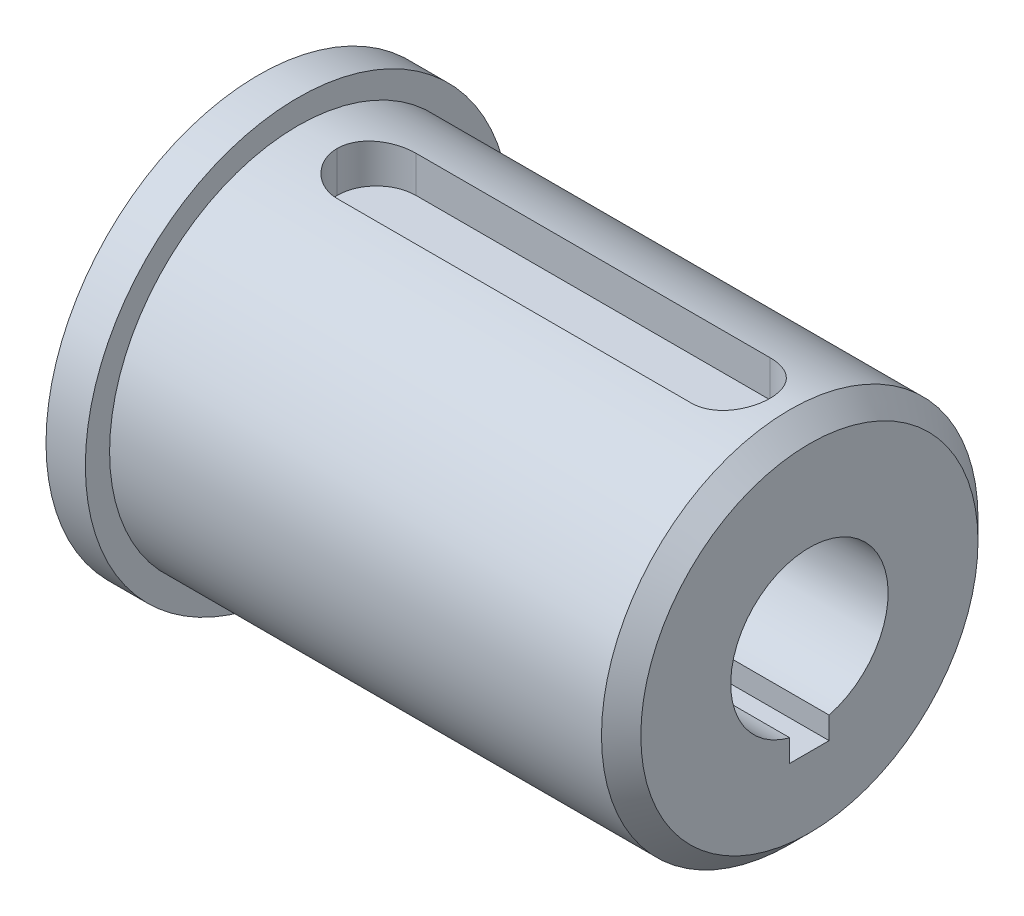
ISO-10303-21;
HEADER;
FILE_DESCRIPTION(('STEP AP214'),'2;1');
FILE_NAME('part.step','',(''),(''),'','','');
FILE_SCHEMA(('AUTOMOTIVE_DESIGN { 1 0 10303 214 1 1 1 1 }'));
ENDSEC;
DATA;
#1=APPLICATION_CONTEXT('core data for automotive mechanical design processes');
#2=APPLICATION_PROTOCOL_DEFINITION('international standard','automotive_design',2000,#1);
#3=PRODUCT_CONTEXT('',#1,'mechanical');
#4=PRODUCT('Part','Part','',(#3));
#5=PRODUCT_RELATED_PRODUCT_CATEGORY('part','',(#4));
#6=PRODUCT_DEFINITION_FORMATION('','',#4);
#7=PRODUCT_DEFINITION_CONTEXT('part definition',#1,'design');
#8=PRODUCT_DEFINITION('design','',#6,#7);
#9=PRODUCT_DEFINITION_SHAPE('','',#8);
#10=(LENGTH_UNIT() NAMED_UNIT(*) SI_UNIT(.MILLI.,.METRE.));
#11=(NAMED_UNIT(*) PLANE_ANGLE_UNIT() SI_UNIT($,.RADIAN.));
#12=(NAMED_UNIT(*) SI_UNIT($,.STERADIAN.) SOLID_ANGLE_UNIT());
#13=UNCERTAINTY_MEASURE_WITH_UNIT(LENGTH_MEASURE(1.E-05),#10,'distance_accuracy_value','');
#14=(GEOMETRIC_REPRESENTATION_CONTEXT(3) GLOBAL_UNCERTAINTY_ASSIGNED_CONTEXT((#13)) GLOBAL_UNIT_ASSIGNED_CONTEXT((#10,
#11,#12)) REPRESENTATION_CONTEXT('',''));
#15=CARTESIAN_POINT('',(0.,0.,0.));
#16=DIRECTION('',(0.,0.,1.));
#17=DIRECTION('',(1.,0.,0.));
#18=AXIS2_PLACEMENT_3D('',#15,#16,#17);
#19=CARTESIAN_POINT('',(0.,18.25625,-3.175));
#20=DIRECTION('',(0.,0.,-1.));
#21=DIRECTION('',(0.,1.,0.));
#22=AXIS2_PLACEMENT_3D('',#19,#20,#21);
#23=PLANE('',#22);
#24=DIRECTION('',(1.,0.,0.));
#25=VECTOR('',#24,1.);
#26=CARTESIAN_POINT('',(0.,11.90625,-3.175));
#27=LINE('',#26,#25);
#28=CARTESIAN_POINT('',(6.35,11.90625,-3.175));
#29=VERTEX_POINT('',#28);
#30=CARTESIAN_POINT('',(34.925,11.90625,-3.175));
#31=VERTEX_POINT('',#30);
#32=EDGE_CURVE('E149',#29,#31,#27,.T.);
#33=ORIENTED_EDGE('',*,*,#32,.T.);
#34=DIRECTION('',(0.,-1.,0.));
#35=VECTOR('',#34,1.);
#36=CARTESIAN_POINT('',(34.925,14.8536585271104,-3.175));
#37=LINE('',#36,#35);
#38=CARTESIAN_POINT('',(34.925,14.8536585271104,-3.175));
#39=VERTEX_POINT('',#38);
#40=EDGE_CURVE('E190',#31,#39,#37,.F.);
#41=ORIENTED_EDGE('',*,*,#40,.T.);
#42=DIRECTION('',(-1.,0.,0.));
#43=VECTOR('',#42,1.);
#44=CARTESIAN_POINT('',(41.275,14.8536585271104,-3.175));
#45=LINE('',#44,#43);
#46=CARTESIAN_POINT('',(6.35,14.8536585271104,-3.175));
#47=VERTEX_POINT('',#46);
#48=EDGE_CURVE('E172',#47,#39,#45,.F.);
#49=ORIENTED_EDGE('',*,*,#48,.F.);
#50=DIRECTION('',(0.,1.,0.));
#51=VECTOR('',#50,1.);
#52=CARTESIAN_POINT('',(6.35,18.25625,-3.175));
#53=LINE('',#52,#51);
#54=EDGE_CURVE('E187',#47,#29,#53,.F.);
#55=ORIENTED_EDGE('',*,*,#54,.T.);
#56=EDGE_LOOP('',(#33,#41,#49,#55));
#57=FACE_BOUND('',#56,.T.);
#58=ADVANCED_FACE('F34',(#57),#23,.F.);
#59=CARTESIAN_POINT('',(0.,18.25625,3.175));
#60=DIRECTION('',(0.,0.,1.));
#61=DIRECTION('',(0.,-1.,0.));
#62=AXIS2_PLACEMENT_3D('',#59,#60,#61);
#63=PLANE('',#62);
#64=DIRECTION('',(-1.,0.,0.));
#65=VECTOR('',#64,1.);
#66=CARTESIAN_POINT('',(41.275,14.8536585271104,3.175));
#67=LINE('',#66,#65);
#68=CARTESIAN_POINT('',(34.925,14.8536585271104,3.175));
#69=VERTEX_POINT('',#68);
#70=CARTESIAN_POINT('',(6.35,14.8536585271104,3.175));
#71=VERTEX_POINT('',#70);
#72=EDGE_CURVE('E170',#69,#71,#67,.T.);
#73=ORIENTED_EDGE('',*,*,#72,.F.);
#74=DIRECTION('',(0.,1.,0.));
#75=VECTOR('',#74,1.);
#76=CARTESIAN_POINT('',(34.925,11.90625,3.175));
#77=LINE('',#76,#75);
#78=CARTESIAN_POINT('',(34.925,11.90625,3.175));
#79=VERTEX_POINT('',#78);
#80=EDGE_CURVE('E176',#69,#79,#77,.F.);
#81=ORIENTED_EDGE('',*,*,#80,.T.);
#82=DIRECTION('',(1.,0.,0.));
#83=VECTOR('',#82,1.);
#84=CARTESIAN_POINT('',(0.,11.90625,3.175));
#85=LINE('',#84,#83);
#86=CARTESIAN_POINT('',(6.35,11.90625,3.175));
#87=VERTEX_POINT('',#86);
#88=EDGE_CURVE('E145',#87,#79,#85,.T.);
#89=ORIENTED_EDGE('',*,*,#88,.F.);
#90=DIRECTION('',(0.,-1.,0.));
#91=VECTOR('',#90,1.);
#92=CARTESIAN_POINT('',(6.35,18.25625,3.175));
#93=LINE('',#92,#91);
#94=EDGE_CURVE('E174',#87,#71,#93,.F.);
#95=ORIENTED_EDGE('',*,*,#94,.T.);
#96=EDGE_LOOP('',(#73,#81,#89,#95));
#97=FACE_BOUND('',#96,.T.);
#98=ADVANCED_FACE('F247',(#97),#63,.F.);
#99=CARTESIAN_POINT('',(0.,11.90625,-3.175));
#100=DIRECTION('',(0.,-1.,0.));
#101=DIRECTION('',(0.,0.,-1.));
#102=AXIS2_PLACEMENT_3D('',#99,#100,#101);
#103=PLANE('',#102);
#104=ORIENTED_EDGE('',*,*,#88,.T.);
#105=CARTESIAN_POINT('',(34.925,11.90625,0.));
#106=DIRECTION('',(0.,-1.,0.));
#107=DIRECTION('',(0.,0.,-1.));
#108=AXIS2_PLACEMENT_3D('',#105,#106,#107);
#109=CIRCLE('',#108,3.175);
#110=CARTESIAN_POINT('',(38.1,11.90625,0.));
#111=VERTEX_POINT('',#110);
#112=EDGE_CURVE('E185',#79,#111,#109,.F.);
#113=ORIENTED_EDGE('',*,*,#112,.T.);
#114=CARTESIAN_POINT('',(34.925,11.90625,0.));
#115=DIRECTION('',(0.,-1.,0.));
#116=DIRECTION('',(0.,0.,-1.));
#117=AXIS2_PLACEMENT_3D('',#114,#115,#116);
#118=CIRCLE('',#117,3.175);
#119=EDGE_CURVE('E183',#111,#31,#118,.F.);
#120=ORIENTED_EDGE('',*,*,#119,.T.);
#121=ORIENTED_EDGE('',*,*,#32,.F.);
#122=CARTESIAN_POINT('',(6.35,11.90625,0.));
#123=DIRECTION('',(0.,-1.,0.));
#124=DIRECTION('',(0.,0.,-1.));
#125=AXIS2_PLACEMENT_3D('',#122,#123,#124);
#126=CIRCLE('',#125,3.175);
#127=CARTESIAN_POINT('',(3.175,11.90625,0.));
#128=VERTEX_POINT('',#127);
#129=EDGE_CURVE('E181',#29,#128,#126,.F.);
#130=ORIENTED_EDGE('',*,*,#129,.T.);
#131=CARTESIAN_POINT('',(6.35,11.90625,0.));
#132=DIRECTION('',(0.,-1.,0.));
#133=DIRECTION('',(0.,0.,-1.));
#134=AXIS2_PLACEMENT_3D('',#131,#132,#133);
#135=CIRCLE('',#134,3.175);
#136=EDGE_CURVE('E179',#128,#87,#135,.F.);
#137=ORIENTED_EDGE('',*,*,#136,.T.);
#138=EDGE_LOOP('',(#104,#113,#120,#121,#130,#137));
#139=FACE_BOUND('',#138,.T.);
#140=ADVANCED_FACE('F253',(#139),#103,.F.);
#141=CARTESIAN_POINT('',(0.,0.,0.));
#142=DIRECTION('',(-1.,0.,0.));
#143=DIRECTION('',(0.,0.,1.));
#144=AXIS2_PLACEMENT_3D('',#141,#142,#143);
#145=PLANE('',#144);
#146=CARTESIAN_POINT('',(0.,0.,0.));
#147=DIRECTION('',(-1.,0.,0.));
#148=DIRECTION('',(0.,0.,1.));
#149=AXIS2_PLACEMENT_3D('',#146,#147,#148);
#150=CIRCLE('',#149,17.145);
#151=CARTESIAN_POINT('',(0.,0.,17.145));
#152=VERTEX_POINT('',#151);
#153=EDGE_CURVE('E140',#152,#152,#150,.T.);
#154=ORIENTED_EDGE('',*,*,#153,.F.);
#155=EDGE_LOOP('',(#154));
#156=FACE_BOUND('',#155,.T.);
#157=CARTESIAN_POINT('',(0.,0.,0.));
#158=DIRECTION('',(1.,0.,0.));
#159=DIRECTION('',(0.,0.,-1.));
#160=AXIS2_PLACEMENT_3D('',#157,#158,#159);
#161=CIRCLE('',#160,15.1892);
#162=CARTESIAN_POINT('',(0.,0.,-15.1892));
#163=VERTEX_POINT('',#162);
#164=EDGE_CURVE('E123',#163,#163,#161,.T.);
#165=ORIENTED_EDGE('',*,*,#164,.F.);
#166=EDGE_LOOP('',(#165));
#167=FACE_BOUND('',#166,.T.);
#168=ADVANCED_FACE('F271',(#156,#167),#145,.F.);
#169=CARTESIAN_POINT('',(41.275,0.,0.));
#170=DIRECTION('',(1.,0.,0.));
#171=DIRECTION('',(0.,0.,-1.));
#172=AXIS2_PLACEMENT_3D('',#169,#170,#171);
#173=PLANE('',#172);
#174=CARTESIAN_POINT('',(41.275,0.,0.));
#175=DIRECTION('',(1.,0.,0.));
#176=DIRECTION('',(0.,0.,-1.));
#177=AXIS2_PLACEMENT_3D('',#174,#175,#176);
#178=CIRCLE('',#177,13.6017);
#179=CARTESIAN_POINT('',(41.275,0.,-13.6017));
#180=VERTEX_POINT('',#179);
#181=EDGE_CURVE('E42',#180,#180,#178,.T.);
#182=ORIENTED_EDGE('',*,*,#181,.T.);
#183=EDGE_LOOP('',(#182));
#184=FACE_BOUND('',#183,.T.);
#185=DIRECTION('',(0.,-1.,0.));
#186=VECTOR('',#185,1.);
#187=CARTESIAN_POINT('',(41.275,-7.9375,1.5875));
#188=LINE('',#187,#186);
#189=CARTESIAN_POINT('',(41.275,-6.14836106210428,1.5875));
#190=VERTEX_POINT('',#189);
#191=CARTESIAN_POINT('',(41.275,-7.9375,1.5875));
#192=VERTEX_POINT('',#191);
#193=EDGE_CURVE('E152',#190,#192,#188,.T.);
#194=ORIENTED_EDGE('',*,*,#193,.F.);
#195=CARTESIAN_POINT('',(41.275,0.,0.));
#196=DIRECTION('',(1.,0.,0.));
#197=DIRECTION('',(0.,0.,-1.));
#198=AXIS2_PLACEMENT_3D('',#195,#196,#197);
#199=CIRCLE('',#198,6.35);
#200=CARTESIAN_POINT('',(41.275,-6.14836106210427,-1.5875));
#201=VERTEX_POINT('',#200);
#202=EDGE_CURVE('E163',#201,#190,#199,.T.);
#203=ORIENTED_EDGE('',*,*,#202,.F.);
#204=DIRECTION('',(0.,1.,0.));
#205=VECTOR('',#204,1.);
#206=CARTESIAN_POINT('',(41.275,-7.9375,-1.5875));
#207=LINE('',#206,#205);
#208=CARTESIAN_POINT('',(41.275,-7.9375,-1.5875));
#209=VERTEX_POINT('',#208);
#210=EDGE_CURVE('E118',#209,#201,#207,.T.);
#211=ORIENTED_EDGE('',*,*,#210,.F.);
#212=DIRECTION('',(0.,0.,-1.));
#213=VECTOR('',#212,1.);
#214=CARTESIAN_POINT('',(41.275,-7.9375,1.5875));
#215=LINE('',#214,#213);
#216=EDGE_CURVE('E156',#192,#209,#215,.T.);
#217=ORIENTED_EDGE('',*,*,#216,.F.);
#218=EDGE_LOOP('',(#194,#203,#211,#217));
#219=FACE_BOUND('',#218,.T.);
#220=ADVANCED_FACE('F238',(#184,#219),#173,.T.);
#221=CARTESIAN_POINT('',(41.275,0.,0.));
#222=DIRECTION('',(-1.,0.,0.));
#223=DIRECTION('',(0.,0.,1.));
#224=AXIS2_PLACEMENT_3D('',#221,#222,#223);
#225=CYLINDRICAL_SURFACE('',#224,15.1892);
#226=CARTESIAN_POINT('',(39.6875,0.,0.));
#227=DIRECTION('',(1.,0.,0.));
#228=DIRECTION('',(0.,0.,-1.));
#229=AXIS2_PLACEMENT_3D('',#226,#227,#228);
#230=CIRCLE('',#229,15.1892);
#231=CARTESIAN_POINT('',(39.6875,0.,-15.1892));
#232=VERTEX_POINT('',#231);
#233=EDGE_CURVE('E11',#232,#232,#230,.F.);
#234=ORIENTED_EDGE('',*,*,#233,.T.);
#235=EDGE_LOOP('',(#234));
#236=FACE_BOUND('',#235,.T.);
#237=ORIENTED_EDGE('',*,*,#48,.T.);
#238=CARTESIAN_POINT('',(34.925,14.8536585271104,-3.175));
#239=CARTESIAN_POINT('',(35.0132603796228,14.8536504934295,-3.17500968963795));
#240=CARTESIAN_POINT('',(35.1015153437493,14.8544450149248,-3.17131985198274));
#241=CARTESIAN_POINT('',(35.2773742015402,14.8575796673476,-3.15661629285255));
#242=CARTESIAN_POINT('',(35.3649781789923,14.8599195957568,-3.14560353101021));
#243=CARTESIAN_POINT('',(35.5387742743639,14.8660804851954,-3.11635349424753));
#244=CARTESIAN_POINT('',(35.6249684898802,14.8698989874874,-3.0981282120071));
#245=CARTESIAN_POINT('',(35.7954584479129,14.8788980861861,-3.05461582892112));
#246=CARTESIAN_POINT('',(35.8797541798279,14.8840786901969,-3.02932868865174));
#247=CARTESIAN_POINT('',(36.1289251513631,14.9014521175503,-2.94312894202631));
#248=CARTESIAN_POINT('',(36.2902247958708,14.9154819023119,-2.87185415211912));
#249=CARTESIAN_POINT('',(36.598520431165,14.9468465246882,-2.70385454387476));
#250=CARTESIAN_POINT('',(36.7455141561235,14.9641818845704,-2.60712570298122));
#251=CARTESIAN_POINT('',(37.0233566838144,15.0005011854153,-2.38936872399542));
#252=CARTESIAN_POINT('',(37.1539567537224,15.0195044558296,-2.26802588549485));
#253=CARTESIAN_POINT('',(37.3931136168853,15.0568509854746,-2.00514974117313));
#254=CARTESIAN_POINT('',(37.5016662470515,15.0751941195187,-1.86361263076007));
#255=CARTESIAN_POINT('',(37.6946438275131,15.109366777981,-1.56267861427147));
#256=CARTESIAN_POINT('',(37.7788216194783,15.125169876526,-1.4031201136036));
#257=CARTESIAN_POINT('',(37.919031766361,15.1522487046577,-1.07177601425931));
#258=CARTESIAN_POINT('',(37.9750841878883,15.1635276609288,-0.899999233153481));
#259=CARTESIAN_POINT('',(38.0440065522533,15.1775699030785,-0.606049994498474));
#260=CARTESIAN_POINT('',(38.0649780473698,15.1819072935285,-0.485789914062021));
#261=CARTESIAN_POINT('',(38.092980047027,15.1877325073427,-0.24370623533063));
#262=CARTESIAN_POINT('',(38.1000236912923,15.1892230164483,-0.121884219922205));
#263=CARTESIAN_POINT('',(38.1,15.1892,0.));
#264=B_SPLINE_CURVE_WITH_KNOTS('',3,(#238,#239,#240,#241,#242,#243,#244,#245,#246,#247,#248,
#249,#250,#251,#252,#253,#254,#255,#256,#257,#258,#259,#260,#261,#262,#263),.UNSPECIFIED.,.F.,
.F.,(4,2,2,2,2,2,2,2,2,2,2,2,4),(0.,0.264691026500312,0.529347373398042,0.793565497295778,
1.05778509625844,1.58580146523989,2.11390132790521,2.64923506275452,3.18466978774648,
3.72535751705036,4.26565893136106,4.63132618436773,4.99664829699746),.UNSPECIFIED.);
#265=CARTESIAN_POINT('',(38.1,15.1892,0.));
#266=VERTEX_POINT('',#265);
#267=EDGE_CURVE('E56',#39,#266,#264,.T.);
#268=ORIENTED_EDGE('',*,*,#267,.T.);
#269=CARTESIAN_POINT('',(38.1,15.1892,0.));
#270=CARTESIAN_POINT('',(38.1000096388734,15.1892073697346,0.0882817094495882));
#271=CARTESIAN_POINT('',(38.0963180680449,15.1884305040033,0.176558122593283));
#272=CARTESIAN_POINT('',(38.0816072379887,15.1853628917779,0.352461088077718));
#273=CARTESIAN_POINT('',(38.0705888932719,15.1830723342196,0.440087720142571));
#274=CARTESIAN_POINT('',(38.0413229140244,15.1770367912798,0.613933407633705));
#275=CARTESIAN_POINT('',(38.0230870086928,15.1732941658359,0.700154511639417));
#276=CARTESIAN_POINT('',(37.9795482419216,15.1644646025262,0.870698591928372));
#277=CARTESIAN_POINT('',(37.9542453518591,15.1593776592157,0.955021560522247));
#278=CARTESIAN_POINT('',(37.8679884594688,15.1422958353714,1.20427831954405));
#279=CARTESIAN_POINT('',(37.7966632210943,15.128474933887,1.36563559493338));
#280=CARTESIAN_POINT('',(37.6285456878259,15.0974682432908,1.67402649767204));
#281=CARTESIAN_POINT('',(37.5317498280573,15.0802819832487,1.82105811604836));
#282=CARTESIAN_POINT('',(37.3139244495366,15.0441507377662,2.09885811183218));
#283=CARTESIAN_POINT('',(37.1925953335115,15.0251857379266,2.22938936908965));
#284=CARTESIAN_POINT('',(36.9297750614609,14.9877753854418,2.46841343769334));
#285=CARTESIAN_POINT('',(36.788279797163,14.9693301396008,2.57690174747281));
#286=CARTESIAN_POINT('',(36.4873842957431,14.9348478176117,2.76981022562079));
#287=CARTESIAN_POINT('',(36.3278151689298,14.9188374057475,2.85397189513364));
#288=CARTESIAN_POINT('',(35.996449794242,14.8913399427644,2.99414856868617));
#289=CARTESIAN_POINT('',(35.8246625792581,14.8798495901583,3.05018412455057));
#290=CARTESIAN_POINT('',(35.530759499522,14.8655330099739,3.11906040588007));
#291=CARTESIAN_POINT('',(35.4105598914938,14.8611062889562,3.14001120346821));
#292=CARTESIAN_POINT('',(35.1685934167073,14.8551578003828,3.167986530058));
#293=CARTESIAN_POINT('',(35.0468280868497,14.8536333748952,3.17502380134065));
#294=CARTESIAN_POINT('',(34.925,14.8536585271104,3.175));
#295=B_SPLINE_CURVE_WITH_KNOTS('',3,(#269,#270,#271,#272,#273,#274,#275,#276,#277,#278,#279,
#280,#281,#282,#283,#284,#285,#286,#287,#288,#289,#290,#291,#292,#293,#294),.UNSPECIFIED.,.F.,
.F.,(4,2,2,2,2,2,2,2,2,2,2,2,4),(0.,0.26475530881017,0.529477577679079,0.793771403376173,
1.05806629953809,1.58624830200472,2.11450426831986,2.64964990138932,3.18490471123135,
3.7256540734501,4.26600773137621,4.63149529654179,4.99664798567611),.UNSPECIFIED.);
#296=EDGE_CURVE('E192',#266,#69,#295,.T.);
#297=ORIENTED_EDGE('',*,*,#296,.T.);
#298=ORIENTED_EDGE('',*,*,#72,.T.);
#299=CARTESIAN_POINT('',(6.35,14.8536585271104,3.175));
#300=CARTESIAN_POINT('',(6.26173962037716,14.8536504934295,3.17500968963795));
#301=CARTESIAN_POINT('',(6.17348465625069,14.8544450149248,3.17131985198274));
#302=CARTESIAN_POINT('',(5.99762579845985,14.8575796673476,3.15661629285255));
#303=CARTESIAN_POINT('',(5.91002182100774,14.8599195957568,3.14560353101021));
#304=CARTESIAN_POINT('',(5.73622572563609,14.8660804851954,3.11635349424753));
#305=CARTESIAN_POINT('',(5.65003151011977,14.8698989874874,3.0981282120071));
#306=CARTESIAN_POINT('',(5.47954155208707,14.8788980861861,3.05461582892112));
#307=CARTESIAN_POINT('',(5.39524582017209,14.8840786901969,3.02932868865174));
#308=CARTESIAN_POINT('',(5.14607484863694,14.9014521175503,2.94312894202631));
#309=CARTESIAN_POINT('',(4.9847752041292,14.9154819023119,2.87185415211912));
#310=CARTESIAN_POINT('',(4.67647956883496,14.9468465246882,2.70385454387476));
#311=CARTESIAN_POINT('',(4.52948584387654,14.9641818845704,2.60712570298122));
#312=CARTESIAN_POINT('',(4.25164331618563,15.0005011854153,2.38936872399543));
#313=CARTESIAN_POINT('',(4.1210432462776,15.0195044558296,2.26802588549486));
#314=CARTESIAN_POINT('',(3.88188638311471,15.0568509854746,2.00514974117313));
#315=CARTESIAN_POINT('',(3.77333375294852,15.0751941195187,1.86361263076008));
#316=CARTESIAN_POINT('',(3.58035617248694,15.109366777981,1.56267861427147));
#317=CARTESIAN_POINT('',(3.49617838052166,15.125169876526,1.40312011360361));
#318=CARTESIAN_POINT('',(3.35596823363903,15.1522487046577,1.07177601425932));
#319=CARTESIAN_POINT('',(3.2999158121117,15.1635276609288,0.899999233153485));
#320=CARTESIAN_POINT('',(3.23099344774667,15.1775699030785,0.606049994498478));
#321=CARTESIAN_POINT('',(3.21002195263023,15.1819072935285,0.485789914062025));
#322=CARTESIAN_POINT('',(3.18201995297299,15.1877325073427,0.243706235330633));
#323=CARTESIAN_POINT('',(3.17497630870775,15.1892230164483,0.121884219922207));
#324=CARTESIAN_POINT('',(3.175,15.1892,0.));
#325=B_SPLINE_CURVE_WITH_KNOTS('',3,(#299,#300,#301,#302,#303,#304,#305,#306,#307,#308,#309,
#310,#311,#312,#313,#314,#315,#316,#317,#318,#319,#320,#321,#322,#323,#324),.UNSPECIFIED.,.F.,
.F.,(4,2,2,2,2,2,2,2,2,2,2,2,4),(0.,0.264691026500313,0.529347373398043,0.793565497295774,
1.05778509625844,1.58580146523989,2.1139013279052,2.64923506275451,3.18466978774647,
3.72535751705036,4.26565893136106,4.63132618436773,4.99664829699746),.UNSPECIFIED.);
#326=CARTESIAN_POINT('',(3.175,15.1892,0.));
#327=VERTEX_POINT('',#326);
#328=EDGE_CURVE('E49',#71,#327,#325,.T.);
#329=ORIENTED_EDGE('',*,*,#328,.T.);
#330=CARTESIAN_POINT('',(3.175,15.1892,0.));
#331=CARTESIAN_POINT('',(3.17499036112661,15.1892073697346,-0.0882817094495865));
#332=CARTESIAN_POINT('',(3.17868193195513,15.1884305040033,-0.176558122593281));
#333=CARTESIAN_POINT('',(3.19339276201135,15.1853628917779,-0.352461088077716));
#334=CARTESIAN_POINT('',(3.20441110672815,15.1830723342196,-0.440087720142568));
#335=CARTESIAN_POINT('',(3.23367708597563,15.1770367912798,-0.613933407633702));
#336=CARTESIAN_POINT('',(3.25191299130723,15.1732941658359,-0.700154511639414));
#337=CARTESIAN_POINT('',(3.29545175807841,15.1644646025262,-0.870698591928371));
#338=CARTESIAN_POINT('',(3.32075464814087,15.1593776592157,-0.955021560522246));
#339=CARTESIAN_POINT('',(3.40701154053117,15.1422958353714,-1.20427831954405));
#340=CARTESIAN_POINT('',(3.47833677890574,15.128474933887,-1.36563559493338));
#341=CARTESIAN_POINT('',(3.64645431217406,15.0974682432908,-1.67402649767204));
#342=CARTESIAN_POINT('',(3.7432501719427,15.0802819832487,-1.82105811604836));
#343=CARTESIAN_POINT('',(3.96107555046345,15.0441507377662,-2.09885811183218));
#344=CARTESIAN_POINT('',(4.08240466648853,15.0251857379266,-2.22938936908965));
#345=CARTESIAN_POINT('',(4.34522493853908,14.9877753854418,-2.46841343769334));
#346=CARTESIAN_POINT('',(4.48672020283696,14.9693301396008,-2.57690174747281));
#347=CARTESIAN_POINT('',(4.78761570425691,14.9348478176117,-2.76981022562079));
#348=CARTESIAN_POINT('',(4.94718483107019,14.9188374057475,-2.85397189513364));
#349=CARTESIAN_POINT('',(5.27855020575805,14.8913399427644,-2.99414856868617));
#350=CARTESIAN_POINT('',(5.45033742074196,14.8798495901583,-3.05018412455057));
#351=CARTESIAN_POINT('',(5.74424050047797,14.8655330099739,-3.11906040588007));
#352=CARTESIAN_POINT('',(5.86444010850624,14.8611062889562,-3.14001120346821));
#353=CARTESIAN_POINT('',(6.1064065832927,14.8551578003828,-3.16798653005799));
#354=CARTESIAN_POINT('',(6.22817191315034,14.8536333748952,-3.17502380134064));
#355=CARTESIAN_POINT('',(6.35,14.8536585271104,-3.175));
#356=B_SPLINE_CURVE_WITH_KNOTS('',3,(#330,#331,#332,#333,#334,#335,#336,#337,#338,#339,#340,
#341,#342,#343,#344,#345,#346,#347,#348,#349,#350,#351,#352,#353,#354,#355),.UNSPECIFIED.,.F.,
.F.,(4,2,2,2,2,2,2,2,2,2,2,2,4),(0.,0.26475530881017,0.529477577679079,0.793771403376174,
1.05806629953809,1.58624830200473,2.11450426831986,2.64964990138933,3.18490471123135,
3.7256540734501,4.26600773137622,4.63149529654179,4.99664798567611),.UNSPECIFIED.);
#357=EDGE_CURVE('E222',#327,#47,#356,.T.);
#358=ORIENTED_EDGE('',*,*,#357,.T.);
#359=EDGE_LOOP('',(#237,#268,#297,#298,#329,#358));
#360=FACE_BOUND('',#359,.T.);
#361=ORIENTED_EDGE('',*,*,#164,.T.);
#362=EDGE_LOOP('',(#361));
#363=FACE_BOUND('',#362,.T.);
#364=ADVANCED_FACE('F204',(#236,#360,#363),#225,.T.);
#365=CARTESIAN_POINT('',(41.275,0.,0.));
#366=DIRECTION('',(-1.,0.,0.));
#367=DIRECTION('',(0.,0.,1.));
#368=AXIS2_PLACEMENT_3D('',#365,#366,#367);
#369=CYLINDRICAL_SURFACE('',#368,6.35);
#370=DIRECTION('',(-1.,0.,0.));
#371=VECTOR('',#370,1.);
#372=CARTESIAN_POINT('',(41.275,-6.14836106210428,1.5875));
#373=LINE('',#372,#371);
#374=CARTESIAN_POINT('',(-3.175,-6.14836106210428,1.5875));
#375=VERTEX_POINT('',#374);
#376=EDGE_CURVE('E122',#375,#190,#373,.F.);
#377=ORIENTED_EDGE('',*,*,#376,.F.);
#378=CARTESIAN_POINT('',(-3.175,0.,0.));
#379=DIRECTION('',(-1.,0.,0.));
#380=DIRECTION('',(0.,0.,1.));
#381=AXIS2_PLACEMENT_3D('',#378,#379,#380);
#382=CIRCLE('',#381,6.35);
#383=CARTESIAN_POINT('',(-3.175,-6.14836106210427,-1.5875));
#384=VERTEX_POINT('',#383);
#385=EDGE_CURVE('E126',#384,#375,#382,.F.);
#386=ORIENTED_EDGE('',*,*,#385,.F.);
#387=DIRECTION('',(-1.,0.,0.));
#388=VECTOR('',#387,1.);
#389=CARTESIAN_POINT('',(41.275,-6.14836106210427,-1.5875));
#390=LINE('',#389,#388);
#391=EDGE_CURVE('E112',#201,#384,#390,.T.);
#392=ORIENTED_EDGE('',*,*,#391,.F.);
#393=ORIENTED_EDGE('',*,*,#202,.T.);
#394=EDGE_LOOP('',(#377,#386,#392,#393));
#395=FACE_BOUND('',#394,.T.);
#396=ADVANCED_FACE('F127',(#395),#369,.F.);
#397=CARTESIAN_POINT('',(0.,-7.9375,1.5875));
#398=DIRECTION('',(0.,0.,1.));
#399=DIRECTION('',(0.,-1.,0.));
#400=AXIS2_PLACEMENT_3D('',#397,#398,#399);
#401=PLANE('',#400);
#402=ORIENTED_EDGE('',*,*,#376,.T.);
#403=ORIENTED_EDGE('',*,*,#193,.T.);
#404=DIRECTION('',(1.,0.,0.));
#405=VECTOR('',#404,1.);
#406=CARTESIAN_POINT('',(0.,-7.9375,1.5875));
#407=LINE('',#406,#405);
#408=CARTESIAN_POINT('',(-3.175,-7.9375,1.5875));
#409=VERTEX_POINT('',#408);
#410=EDGE_CURVE('E160',#409,#192,#407,.T.);
#411=ORIENTED_EDGE('',*,*,#410,.F.);
#412=DIRECTION('',(0.,-1.,0.));
#413=VECTOR('',#412,1.);
#414=CARTESIAN_POINT('',(-3.175,0.,1.5875));
#415=LINE('',#414,#413);
#416=EDGE_CURVE('E131',#375,#409,#415,.T.);
#417=ORIENTED_EDGE('',*,*,#416,.F.);
#418=EDGE_LOOP('',(#402,#403,#411,#417));
#419=FACE_BOUND('',#418,.T.);
#420=ADVANCED_FACE('F261',(#419),#401,.F.);
#421=CARTESIAN_POINT('',(0.,-7.9375,-1.5875));
#422=DIRECTION('',(0.,0.,-1.));
#423=DIRECTION('',(-1.,0.,0.));
#424=AXIS2_PLACEMENT_3D('',#421,#422,#423);
#425=PLANE('',#424);
#426=ORIENTED_EDGE('',*,*,#391,.T.);
#427=DIRECTION('',(0.,1.,0.));
#428=VECTOR('',#427,1.);
#429=CARTESIAN_POINT('',(-3.175,0.,-1.5875));
#430=LINE('',#429,#428);
#431=CARTESIAN_POINT('',(-3.175,-7.9375,-1.5875));
#432=VERTEX_POINT('',#431);
#433=EDGE_CURVE('E116',#432,#384,#430,.T.);
#434=ORIENTED_EDGE('',*,*,#433,.F.);
#435=DIRECTION('',(1.,0.,0.));
#436=VECTOR('',#435,1.);
#437=CARTESIAN_POINT('',(0.,-7.9375,-1.5875));
#438=LINE('',#437,#436);
#439=EDGE_CURVE('E161',#432,#209,#438,.T.);
#440=ORIENTED_EDGE('',*,*,#439,.T.);
#441=ORIENTED_EDGE('',*,*,#210,.T.);
#442=EDGE_LOOP('',(#426,#434,#440,#441));
#443=FACE_BOUND('',#442,.T.);
#444=ADVANCED_FACE('F114',(#443),#425,.F.);
#445=CARTESIAN_POINT('',(0.,-7.9375,1.5875));
#446=DIRECTION('',(0.,-1.,0.));
#447=DIRECTION('',(0.,0.,-1.));
#448=AXIS2_PLACEMENT_3D('',#445,#446,#447);
#449=PLANE('',#448);
#450=ORIENTED_EDGE('',*,*,#216,.T.);
#451=ORIENTED_EDGE('',*,*,#439,.F.);
#452=DIRECTION('',(0.,0.,-1.));
#453=VECTOR('',#452,1.);
#454=CARTESIAN_POINT('',(-3.175,-7.9375,0.));
#455=LINE('',#454,#453);
#456=EDGE_CURVE('E136',#409,#432,#455,.T.);
#457=ORIENTED_EDGE('',*,*,#456,.F.);
#458=ORIENTED_EDGE('',*,*,#410,.T.);
#459=EDGE_LOOP('',(#450,#451,#457,#458));
#460=FACE_BOUND('',#459,.T.);
#461=ADVANCED_FACE('F260',(#460),#449,.F.);
#462=CARTESIAN_POINT('',(-3.175,0.,0.));
#463=DIRECTION('',(1.,0.,0.));
#464=DIRECTION('',(0.,0.,-1.));
#465=AXIS2_PLACEMENT_3D('',#462,#463,#464);
#466=CYLINDRICAL_SURFACE('',#465,17.145);
#467=CARTESIAN_POINT('',(-3.175,0.,0.));
#468=DIRECTION('',(-1.,0.,0.));
#469=DIRECTION('',(0.,0.,1.));
#470=AXIS2_PLACEMENT_3D('',#467,#468,#469);
#471=CIRCLE('',#470,17.145);
#472=CARTESIAN_POINT('',(-3.175,0.,17.145));
#473=VERTEX_POINT('',#472);
#474=EDGE_CURVE('E137',#473,#473,#471,.T.);
#475=ORIENTED_EDGE('',*,*,#474,.F.);
#476=EDGE_LOOP('',(#475));
#477=FACE_BOUND('',#476,.T.);
#478=ORIENTED_EDGE('',*,*,#153,.T.);
#479=EDGE_LOOP('',(#478));
#480=FACE_BOUND('',#479,.T.);
#481=ADVANCED_FACE('F264',(#477,#480),#466,.T.);
#482=CARTESIAN_POINT('',(-3.175,0.,0.));
#483=DIRECTION('',(-1.,0.,0.));
#484=DIRECTION('',(0.,0.,1.));
#485=AXIS2_PLACEMENT_3D('',#482,#483,#484);
#486=PLANE('',#485);
#487=ORIENTED_EDGE('',*,*,#474,.T.);
#488=EDGE_LOOP('',(#487));
#489=FACE_BOUND('',#488,.T.);
#490=ORIENTED_EDGE('',*,*,#433,.T.);
#491=ORIENTED_EDGE('',*,*,#385,.T.);
#492=ORIENTED_EDGE('',*,*,#416,.T.);
#493=ORIENTED_EDGE('',*,*,#456,.T.);
#494=EDGE_LOOP('',(#490,#491,#492,#493));
#495=FACE_BOUND('',#494,.T.);
#496=ADVANCED_FACE('F134',(#489,#495),#486,.T.);
#497=CARTESIAN_POINT('',(34.925,0.,0.));
#498=DIRECTION('',(0.,1.,0.));
#499=DIRECTION('',(0.,0.,1.));
#500=AXIS2_PLACEMENT_3D('',#497,#498,#499);
#501=CYLINDRICAL_SURFACE('',#500,3.175);
#502=ORIENTED_EDGE('',*,*,#40,.F.);
#503=ORIENTED_EDGE('',*,*,#119,.F.);
#504=DIRECTION('',(0.,-1.,0.));
#505=VECTOR('',#504,1.);
#506=CARTESIAN_POINT('',(38.1,11.90625,0.));
#507=LINE('',#506,#505);
#508=EDGE_CURVE('E148',#266,#111,#507,.T.);
#509=ORIENTED_EDGE('',*,*,#508,.F.);
#510=ORIENTED_EDGE('',*,*,#267,.F.);
#511=EDGE_LOOP('',(#502,#503,#509,#510));
#512=FACE_BOUND('',#511,.T.);
#513=ADVANCED_FACE('F211',(#512),#501,.F.);
#514=CARTESIAN_POINT('',(34.925,0.,0.));
#515=DIRECTION('',(0.,-1.,0.));
#516=DIRECTION('',(0.,0.,-1.));
#517=AXIS2_PLACEMENT_3D('',#514,#515,#516);
#518=CYLINDRICAL_SURFACE('',#517,3.175);
#519=ORIENTED_EDGE('',*,*,#112,.F.);
#520=ORIENTED_EDGE('',*,*,#80,.F.);
#521=ORIENTED_EDGE('',*,*,#296,.F.);
#522=ORIENTED_EDGE('',*,*,#508,.T.);
#523=EDGE_LOOP('',(#519,#520,#521,#522));
#524=FACE_BOUND('',#523,.T.);
#525=ADVANCED_FACE('F207',(#524),#518,.F.);
#526=CARTESIAN_POINT('',(6.35,0.,0.));
#527=DIRECTION('',(0.,-1.,0.));
#528=DIRECTION('',(0.,0.,-1.));
#529=AXIS2_PLACEMENT_3D('',#526,#527,#528);
#530=CYLINDRICAL_SURFACE('',#529,3.175);
#531=ORIENTED_EDGE('',*,*,#94,.F.);
#532=ORIENTED_EDGE('',*,*,#136,.F.);
#533=DIRECTION('',(0.,-1.,0.));
#534=VECTOR('',#533,1.);
#535=CARTESIAN_POINT('',(3.175,0.,0.));
#536=LINE('',#535,#534);
#537=EDGE_CURVE('E233',#327,#128,#536,.T.);
#538=ORIENTED_EDGE('',*,*,#537,.F.);
#539=ORIENTED_EDGE('',*,*,#328,.F.);
#540=EDGE_LOOP('',(#531,#532,#538,#539));
#541=FACE_BOUND('',#540,.T.);
#542=ADVANCED_FACE('F210',(#541),#530,.F.);
#543=CARTESIAN_POINT('',(6.35,0.,0.));
#544=DIRECTION('',(0.,1.,0.));
#545=DIRECTION('',(0.,0.,1.));
#546=AXIS2_PLACEMENT_3D('',#543,#544,#545);
#547=CYLINDRICAL_SURFACE('',#546,3.175);
#548=ORIENTED_EDGE('',*,*,#129,.F.);
#549=ORIENTED_EDGE('',*,*,#54,.F.);
#550=ORIENTED_EDGE('',*,*,#357,.F.);
#551=ORIENTED_EDGE('',*,*,#537,.T.);
#552=EDGE_LOOP('',(#548,#549,#550,#551));
#553=FACE_BOUND('',#552,.T.);
#554=ADVANCED_FACE('F217',(#553),#547,.F.);
#555=CARTESIAN_POINT('',(41.275,0.,0.));
#556=DIRECTION('',(-1.,0.,0.));
#557=DIRECTION('',(0.,0.,1.));
#558=AXIS2_PLACEMENT_3D('',#555,#556,#557);
#559=CONICAL_SURFACE('',#558,13.6017,0.785398163397448);
#560=ORIENTED_EDGE('',*,*,#233,.F.);
#561=EDGE_LOOP('',(#560));
#562=FACE_BOUND('',#561,.T.);
#563=ORIENTED_EDGE('',*,*,#181,.F.);
#564=EDGE_LOOP('',(#563));
#565=FACE_BOUND('',#564,.T.);
#566=ADVANCED_FACE('F36',(#562,#565),#559,.T.);
#567=CLOSED_SHELL('',(#58,#98,#140,#168,#220,#364,#396,#420,#444,#461,#481,#496,#513,#525,#542,
#554,#566));
#568=MANIFOLD_SOLID_BREP('B2',#567);
#569=ADVANCED_BREP_SHAPE_REPRESENTATION('',(#18,#568),#14);
#570=SHAPE_DEFINITION_REPRESENTATION(#9,#569);
ENDSEC;
END-ISO-10303-21;
